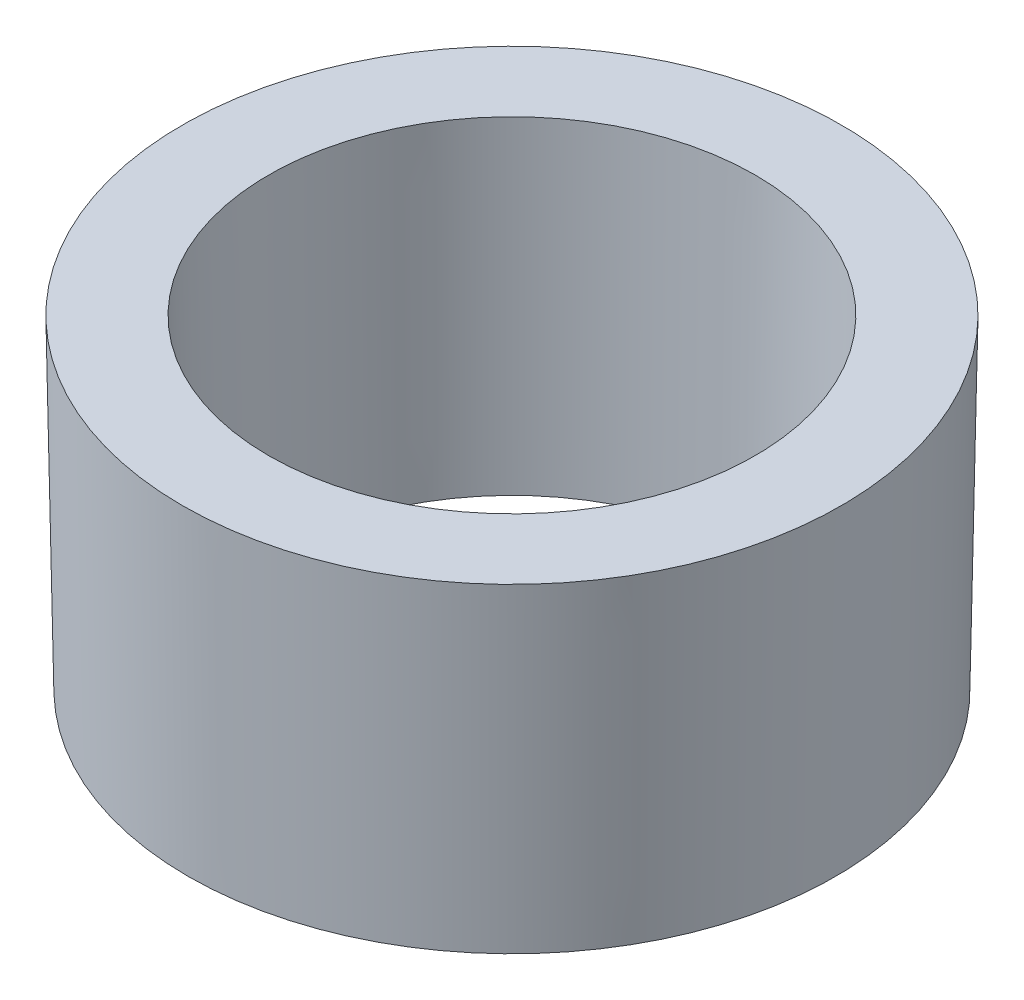
ISO-10303-21;
HEADER;
FILE_DESCRIPTION(('STEP AP214'),'2;1');
FILE_NAME('part.step','',(''),(''),'','','');
FILE_SCHEMA(('AUTOMOTIVE_DESIGN { 1 0 10303 214 1 1 1 1 }'));
ENDSEC;
DATA;
#1=APPLICATION_CONTEXT('core data for automotive mechanical design processes');
#2=APPLICATION_PROTOCOL_DEFINITION('international standard','automotive_design',2000,#1);
#3=PRODUCT_CONTEXT('',#1,'mechanical');
#4=PRODUCT('Part','Part','',(#3));
#5=PRODUCT_RELATED_PRODUCT_CATEGORY('part','',(#4));
#6=PRODUCT_DEFINITION_FORMATION('','',#4);
#7=PRODUCT_DEFINITION_CONTEXT('part definition',#1,'design');
#8=PRODUCT_DEFINITION('design','',#6,#7);
#9=PRODUCT_DEFINITION_SHAPE('','',#8);
#10=(LENGTH_UNIT() NAMED_UNIT(*) SI_UNIT(.MILLI.,.METRE.));
#11=(NAMED_UNIT(*) PLANE_ANGLE_UNIT() SI_UNIT($,.RADIAN.));
#12=(NAMED_UNIT(*) SI_UNIT($,.STERADIAN.) SOLID_ANGLE_UNIT());
#13=UNCERTAINTY_MEASURE_WITH_UNIT(LENGTH_MEASURE(1.E-05),#10,'distance_accuracy_value','');
#14=(GEOMETRIC_REPRESENTATION_CONTEXT(3) GLOBAL_UNCERTAINTY_ASSIGNED_CONTEXT((#13)) GLOBAL_UNIT_ASSIGNED_CONTEXT((#10,
#11,#12)) REPRESENTATION_CONTEXT('',''));
#15=CARTESIAN_POINT('',(0.,0.,0.));
#16=DIRECTION('',(0.,0.,1.));
#17=DIRECTION('',(1.,0.,0.));
#18=AXIS2_PLACEMENT_3D('',#15,#16,#17);
#19=CARTESIAN_POINT('',(0.,0.,0.));
#20=DIRECTION('',(0.,1.,0.));
#21=DIRECTION('',(0.,0.,1.));
#22=AXIS2_PLACEMENT_3D('',#19,#20,#21);
#23=CONICAL_SURFACE('',#22,15.,0.0174532925199433);
#24=CARTESIAN_POINT('',(0.,15.,0.));
#25=DIRECTION('',(0.,1.,0.));
#26=DIRECTION('',(0.,0.,1.));
#27=AXIS2_PLACEMENT_3D('',#24,#25,#26);
#28=CIRCLE('',#27,15.2618259739233);
#29=CARTESIAN_POINT('',(0.,15.,15.2618259739233));
#30=VERTEX_POINT('',#29);
#31=EDGE_CURVE('E10',#30,#30,#28,.T.);
#32=ORIENTED_EDGE('',*,*,#31,.F.);
#33=EDGE_LOOP('',(#32));
#34=FACE_BOUND('',#33,.T.);
#35=CARTESIAN_POINT('',(0.,0.,0.));
#36=DIRECTION('',(0.,1.,0.));
#37=DIRECTION('',(0.,0.,1.));
#38=AXIS2_PLACEMENT_3D('',#35,#36,#37);
#39=CIRCLE('',#38,15.);
#40=CARTESIAN_POINT('',(0.,0.,15.));
#41=VERTEX_POINT('',#40);
#42=EDGE_CURVE('E44',#41,#41,#39,.T.);
#43=ORIENTED_EDGE('',*,*,#42,.T.);
#44=EDGE_LOOP('',(#43));
#45=FACE_BOUND('',#44,.T.);
#46=ADVANCED_FACE('F37',(#34,#45),#23,.T.);
#47=CARTESIAN_POINT('',(0.,15.,0.));
#48=DIRECTION('',(0.,1.,0.));
#49=DIRECTION('',(0.,0.,1.));
#50=AXIS2_PLACEMENT_3D('',#47,#48,#49);
#51=PLANE('',#50);
#52=CARTESIAN_POINT('',(0.,15.,0.));
#53=DIRECTION('',(0.,1.,0.));
#54=DIRECTION('',(0.,0.,1.));
#55=AXIS2_PLACEMENT_3D('',#52,#53,#54);
#56=CIRCLE('',#55,11.2618259739233);
#57=CARTESIAN_POINT('',(0.,15.,11.2618259739233));
#58=VERTEX_POINT('',#57);
#59=EDGE_CURVE('E54',#58,#58,#56,.F.);
#60=ORIENTED_EDGE('',*,*,#59,.T.);
#61=EDGE_LOOP('',(#60));
#62=FACE_BOUND('',#61,.T.);
#63=ORIENTED_EDGE('',*,*,#31,.T.);
#64=EDGE_LOOP('',(#63));
#65=FACE_BOUND('',#64,.T.);
#66=ADVANCED_FACE('F61',(#62,#65),#51,.T.);
#67=CARTESIAN_POINT('',(0.,0.,0.));
#68=DIRECTION('',(0.,1.,0.));
#69=DIRECTION('',(0.,0.,1.));
#70=AXIS2_PLACEMENT_3D('',#67,#68,#69);
#71=PLANE('',#70);
#72=CARTESIAN_POINT('',(0.,0.,0.));
#73=DIRECTION('',(0.,-1.,0.));
#74=DIRECTION('',(0.,0.,-1.));
#75=AXIS2_PLACEMENT_3D('',#72,#73,#74);
#76=CIRCLE('',#75,11.);
#77=CARTESIAN_POINT('',(0.,0.,-11.));
#78=VERTEX_POINT('',#77);
#79=EDGE_CURVE('E49',#78,#78,#76,.T.);
#80=ORIENTED_EDGE('',*,*,#79,.F.);
#81=EDGE_LOOP('',(#80));
#82=FACE_BOUND('',#81,.T.);
#83=ORIENTED_EDGE('',*,*,#42,.F.);
#84=EDGE_LOOP('',(#83));
#85=FACE_BOUND('',#84,.T.);
#86=ADVANCED_FACE('F66',(#82,#85),#71,.F.);
#87=CARTESIAN_POINT('',(0.,0.,0.));
#88=DIRECTION('',(0.,1.,0.));
#89=DIRECTION('',(0.,0.,-1.));
#90=AXIS2_PLACEMENT_3D('',#87,#88,#89);
#91=CONICAL_SURFACE('',#90,11.,0.0174532925199433);
#92=ORIENTED_EDGE('',*,*,#59,.F.);
#93=EDGE_LOOP('',(#92));
#94=FACE_BOUND('',#93,.T.);
#95=ORIENTED_EDGE('',*,*,#79,.T.);
#96=EDGE_LOOP('',(#95));
#97=FACE_BOUND('',#96,.T.);
#98=ADVANCED_FACE('F63',(#94,#97),#91,.F.);
#99=CLOSED_SHELL('',(#46,#66,#86,#98));
#100=MANIFOLD_SOLID_BREP('B2',#99);
#101=ADVANCED_BREP_SHAPE_REPRESENTATION('',(#18,#100),#14);
#102=SHAPE_DEFINITION_REPRESENTATION(#9,#101);
ENDSEC;
END-ISO-10303-21;
